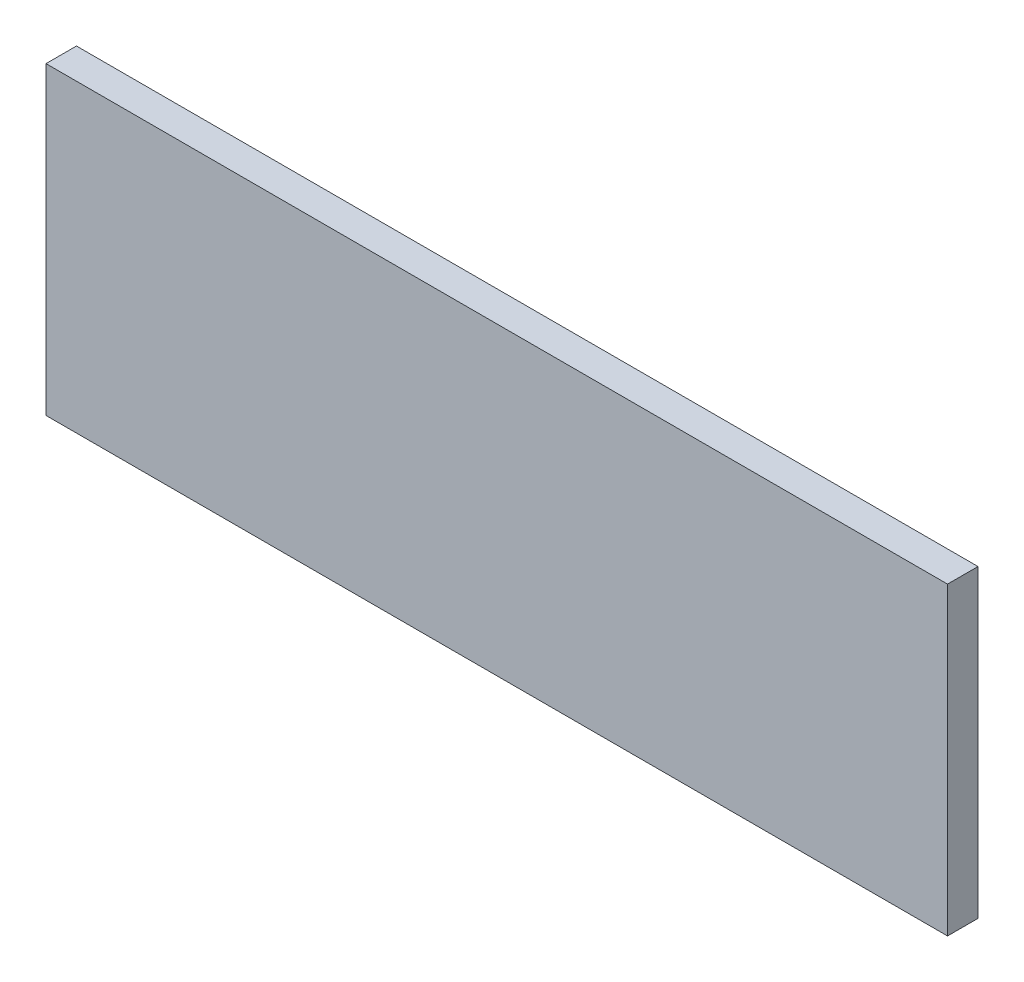
ISO-10303-21;
HEADER;
FILE_DESCRIPTION(('STEP AP214'),'2;1');
FILE_NAME('part.step','',(''),(''),'','','');
FILE_SCHEMA(('AUTOMOTIVE_DESIGN { 1 0 10303 214 1 1 1 1 }'));
ENDSEC;
DATA;
#1=APPLICATION_CONTEXT('core data for automotive mechanical design processes');
#2=APPLICATION_PROTOCOL_DEFINITION('international standard','automotive_design',2000,#1);
#3=PRODUCT_CONTEXT('',#1,'mechanical');
#4=PRODUCT('Part','Part','',(#3));
#5=PRODUCT_RELATED_PRODUCT_CATEGORY('part','',(#4));
#6=PRODUCT_DEFINITION_FORMATION('','',#4);
#7=PRODUCT_DEFINITION_CONTEXT('part definition',#1,'design');
#8=PRODUCT_DEFINITION('design','',#6,#7);
#9=PRODUCT_DEFINITION_SHAPE('','',#8);
#10=(LENGTH_UNIT() NAMED_UNIT(*) SI_UNIT(.MILLI.,.METRE.));
#11=(NAMED_UNIT(*) PLANE_ANGLE_UNIT() SI_UNIT($,.RADIAN.));
#12=(NAMED_UNIT(*) SI_UNIT($,.STERADIAN.) SOLID_ANGLE_UNIT());
#13=UNCERTAINTY_MEASURE_WITH_UNIT(LENGTH_MEASURE(1.E-05),#10,'distance_accuracy_value','');
#14=(GEOMETRIC_REPRESENTATION_CONTEXT(3) GLOBAL_UNCERTAINTY_ASSIGNED_CONTEXT((#13)) GLOBAL_UNIT_ASSIGNED_CONTEXT((#10,
#11,#12)) REPRESENTATION_CONTEXT('',''));
#15=CARTESIAN_POINT('',(0.,0.,0.));
#16=DIRECTION('',(0.,0.,1.));
#17=DIRECTION('',(1.,0.,0.));
#18=AXIS2_PLACEMENT_3D('',#15,#16,#17);
#19=CARTESIAN_POINT('',(0.,0.,3.));
#20=DIRECTION('',(1.,0.,0.));
#21=DIRECTION('',(0.,0.,-1.));
#22=AXIS2_PLACEMENT_3D('',#19,#20,#21);
#23=PLANE('',#22);
#24=DIRECTION('',(0.,-1.,0.));
#25=VECTOR('',#24,1.);
#26=CARTESIAN_POINT('',(0.,0.,0.));
#27=LINE('',#26,#25);
#28=CARTESIAN_POINT('',(0.,0.,0.));
#29=VERTEX_POINT('',#28);
#30=CARTESIAN_POINT('',(0.,-30.,0.));
#31=VERTEX_POINT('',#30);
#32=EDGE_CURVE('E100',#29,#31,#27,.T.);
#33=ORIENTED_EDGE('',*,*,#32,.T.);
#34=DIRECTION('',(0.,0.,-1.));
#35=VECTOR('',#34,1.);
#36=CARTESIAN_POINT('',(0.,-30.,3.));
#37=LINE('',#36,#35);
#38=CARTESIAN_POINT('',(0.,-30.,3.));
#39=VERTEX_POINT('',#38);
#40=EDGE_CURVE('E11',#39,#31,#37,.T.);
#41=ORIENTED_EDGE('',*,*,#40,.F.);
#42=DIRECTION('',(0.,-1.,0.));
#43=VECTOR('',#42,1.);
#44=CARTESIAN_POINT('',(0.,0.,3.));
#45=LINE('',#44,#43);
#46=CARTESIAN_POINT('',(0.,0.,3.));
#47=VERTEX_POINT('',#46);
#48=EDGE_CURVE('E88',#47,#39,#45,.T.);
#49=ORIENTED_EDGE('',*,*,#48,.F.);
#50=DIRECTION('',(0.,0.,-1.));
#51=VECTOR('',#50,1.);
#52=CARTESIAN_POINT('',(0.,0.,3.));
#53=LINE('',#52,#51);
#54=EDGE_CURVE('E96',#47,#29,#53,.T.);
#55=ORIENTED_EDGE('',*,*,#54,.T.);
#56=EDGE_LOOP('',(#33,#41,#49,#55));
#57=FACE_BOUND('',#56,.T.);
#58=ADVANCED_FACE('F37',(#57),#23,.F.);
#59=CARTESIAN_POINT('',(0.,-30.,3.));
#60=DIRECTION('',(0.,1.,0.));
#61=DIRECTION('',(0.,0.,1.));
#62=AXIS2_PLACEMENT_3D('',#59,#60,#61);
#63=PLANE('',#62);
#64=DIRECTION('',(1.,0.,0.));
#65=VECTOR('',#64,1.);
#66=CARTESIAN_POINT('',(0.,-30.,0.));
#67=LINE('',#66,#65);
#68=CARTESIAN_POINT('',(88.75,-30.,0.));
#69=VERTEX_POINT('',#68);
#70=EDGE_CURVE('E92',#31,#69,#67,.T.);
#71=ORIENTED_EDGE('',*,*,#70,.T.);
#72=DIRECTION('',(0.,0.,-1.));
#73=VECTOR('',#72,1.);
#74=CARTESIAN_POINT('',(88.75,-30.,3.));
#75=LINE('',#74,#73);
#76=CARTESIAN_POINT('',(88.75,-30.,3.));
#77=VERTEX_POINT('',#76);
#78=EDGE_CURVE('E45',#77,#69,#75,.T.);
#79=ORIENTED_EDGE('',*,*,#78,.F.);
#80=DIRECTION('',(1.,0.,0.));
#81=VECTOR('',#80,1.);
#82=CARTESIAN_POINT('',(0.,-30.,3.));
#83=LINE('',#82,#81);
#84=EDGE_CURVE('E83',#39,#77,#83,.T.);
#85=ORIENTED_EDGE('',*,*,#84,.F.);
#86=ORIENTED_EDGE('',*,*,#40,.T.);
#87=EDGE_LOOP('',(#71,#79,#85,#86));
#88=FACE_BOUND('',#87,.T.);
#89=ADVANCED_FACE('F91',(#88),#63,.F.);
#90=CARTESIAN_POINT('',(88.75,0.,3.));
#91=DIRECTION('',(-1.,0.,0.));
#92=DIRECTION('',(0.,0.,1.));
#93=AXIS2_PLACEMENT_3D('',#90,#91,#92);
#94=PLANE('',#93);
#95=DIRECTION('',(0.,1.,0.));
#96=VECTOR('',#95,1.);
#97=CARTESIAN_POINT('',(88.75,0.,0.));
#98=LINE('',#97,#96);
#99=CARTESIAN_POINT('',(88.75,0.,0.));
#100=VERTEX_POINT('',#99);
#101=EDGE_CURVE('E70',#69,#100,#98,.T.);
#102=ORIENTED_EDGE('',*,*,#101,.T.);
#103=DIRECTION('',(0.,0.,-1.));
#104=VECTOR('',#103,1.);
#105=CARTESIAN_POINT('',(88.75,0.,3.));
#106=LINE('',#105,#104);
#107=CARTESIAN_POINT('',(88.75,0.,3.));
#108=VERTEX_POINT('',#107);
#109=EDGE_CURVE('E93',#108,#100,#106,.T.);
#110=ORIENTED_EDGE('',*,*,#109,.F.);
#111=DIRECTION('',(0.,1.,0.));
#112=VECTOR('',#111,1.);
#113=CARTESIAN_POINT('',(88.75,0.,3.));
#114=LINE('',#113,#112);
#115=EDGE_CURVE('E86',#77,#108,#114,.T.);
#116=ORIENTED_EDGE('',*,*,#115,.F.);
#117=ORIENTED_EDGE('',*,*,#78,.T.);
#118=EDGE_LOOP('',(#102,#110,#116,#117));
#119=FACE_BOUND('',#118,.T.);
#120=ADVANCED_FACE('F94',(#119),#94,.F.);
#121=CARTESIAN_POINT('',(0.,0.,3.));
#122=DIRECTION('',(0.,-1.,0.));
#123=DIRECTION('',(0.,0.,-1.));
#124=AXIS2_PLACEMENT_3D('',#121,#122,#123);
#125=PLANE('',#124);
#126=DIRECTION('',(-1.,0.,0.));
#127=VECTOR('',#126,1.);
#128=CARTESIAN_POINT('',(0.,0.,0.));
#129=LINE('',#128,#127);
#130=EDGE_CURVE('E76',#100,#29,#129,.T.);
#131=ORIENTED_EDGE('',*,*,#130,.T.);
#132=ORIENTED_EDGE('',*,*,#54,.F.);
#133=DIRECTION('',(-1.,0.,0.));
#134=VECTOR('',#133,1.);
#135=CARTESIAN_POINT('',(0.,0.,3.));
#136=LINE('',#135,#134);
#137=EDGE_CURVE('E53',#108,#47,#136,.T.);
#138=ORIENTED_EDGE('',*,*,#137,.F.);
#139=ORIENTED_EDGE('',*,*,#109,.T.);
#140=EDGE_LOOP('',(#131,#132,#138,#139));
#141=FACE_BOUND('',#140,.T.);
#142=ADVANCED_FACE('F107',(#141),#125,.F.);
#143=CARTESIAN_POINT('',(0.,0.,3.));
#144=DIRECTION('',(0.,0.,1.));
#145=DIRECTION('',(1.,0.,0.));
#146=AXIS2_PLACEMENT_3D('',#143,#144,#145);
#147=PLANE('',#146);
#148=ORIENTED_EDGE('',*,*,#48,.T.);
#149=ORIENTED_EDGE('',*,*,#84,.T.);
#150=ORIENTED_EDGE('',*,*,#115,.T.);
#151=ORIENTED_EDGE('',*,*,#137,.T.);
#152=EDGE_LOOP('',(#148,#149,#150,#151));
#153=FACE_BOUND('',#152,.T.);
#154=ADVANCED_FACE('F84',(#153),#147,.T.);
#155=CARTESIAN_POINT('',(0.,0.,0.));
#156=DIRECTION('',(0.,0.,1.));
#157=DIRECTION('',(1.,0.,0.));
#158=AXIS2_PLACEMENT_3D('',#155,#156,#157);
#159=PLANE('',#158);
#160=ORIENTED_EDGE('',*,*,#32,.F.);
#161=ORIENTED_EDGE('',*,*,#130,.F.);
#162=ORIENTED_EDGE('',*,*,#101,.F.);
#163=ORIENTED_EDGE('',*,*,#70,.F.);
#164=EDGE_LOOP('',(#160,#161,#162,#163));
#165=FACE_BOUND('',#164,.T.);
#166=ADVANCED_FACE('F110',(#165),#159,.F.);
#167=CLOSED_SHELL('',(#58,#89,#120,#142,#154,#166));
#168=MANIFOLD_SOLID_BREP('B2',#167);
#169=ADVANCED_BREP_SHAPE_REPRESENTATION('',(#18,#168),#14);
#170=SHAPE_DEFINITION_REPRESENTATION(#9,#169);
ENDSEC;
END-ISO-10303-21;
